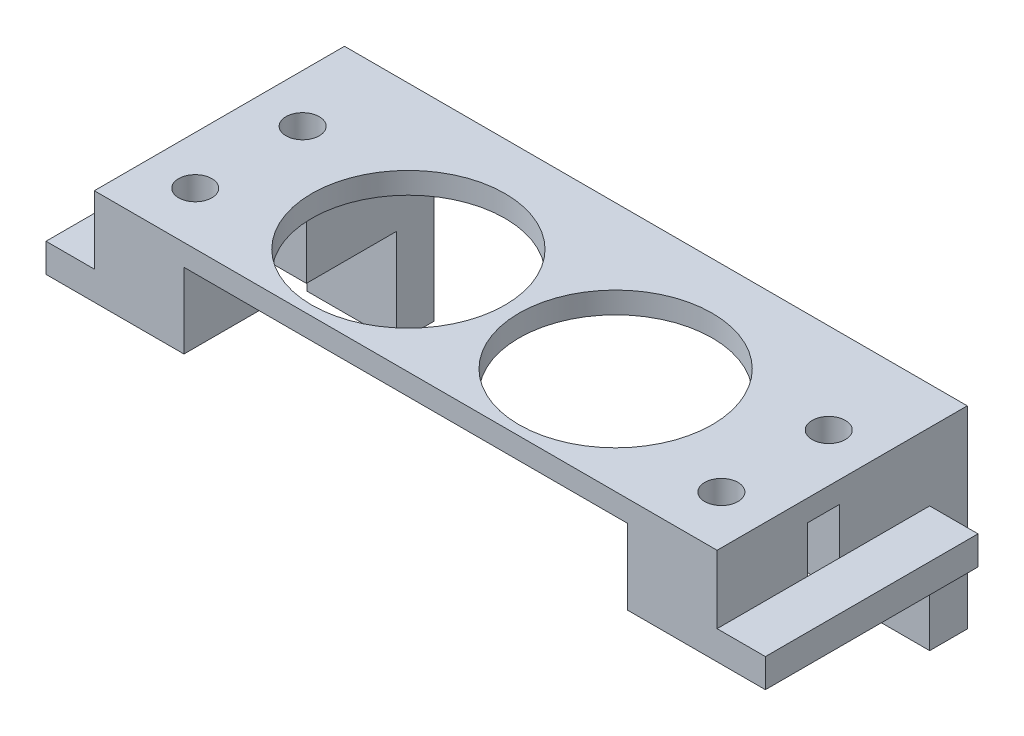
ISO-10303-21;
HEADER;
FILE_DESCRIPTION(('STEP AP214'),'2;1');
FILE_NAME('part.step','',(''),(''),'','','');
FILE_SCHEMA(('AUTOMOTIVE_DESIGN { 1 0 10303 214 1 1 1 1 }'));
ENDSEC;
DATA;
#1=APPLICATION_CONTEXT('core data for automotive mechanical design processes');
#2=APPLICATION_PROTOCOL_DEFINITION('international standard','automotive_design',2000,#1);
#3=PRODUCT_CONTEXT('',#1,'mechanical');
#4=PRODUCT('Part','Part','',(#3));
#5=PRODUCT_RELATED_PRODUCT_CATEGORY('part','',(#4));
#6=PRODUCT_DEFINITION_FORMATION('','',#4);
#7=PRODUCT_DEFINITION_CONTEXT('part definition',#1,'design');
#8=PRODUCT_DEFINITION('design','',#6,#7);
#9=PRODUCT_DEFINITION_SHAPE('','',#8);
#10=(LENGTH_UNIT() NAMED_UNIT(*) SI_UNIT(.MILLI.,.METRE.));
#11=(NAMED_UNIT(*) PLANE_ANGLE_UNIT() SI_UNIT($,.RADIAN.));
#12=(NAMED_UNIT(*) SI_UNIT($,.STERADIAN.) SOLID_ANGLE_UNIT());
#13=UNCERTAINTY_MEASURE_WITH_UNIT(LENGTH_MEASURE(1.E-05),#10,'distance_accuracy_value','');
#14=(GEOMETRIC_REPRESENTATION_CONTEXT(3) GLOBAL_UNCERTAINTY_ASSIGNED_CONTEXT((#13)) GLOBAL_UNIT_ASSIGNED_CONTEXT((#10,
#11,#12)) REPRESENTATION_CONTEXT('',''));
#15=CARTESIAN_POINT('',(0.,0.,0.));
#16=DIRECTION('',(0.,0.,1.));
#17=DIRECTION('',(1.,0.,0.));
#18=AXIS2_PLACEMENT_3D('',#15,#16,#17);
#19=CARTESIAN_POINT('',(-29.,2.,0.));
#20=DIRECTION('',(1.,0.,0.));
#21=DIRECTION('',(0.,0.,-1.));
#22=AXIS2_PLACEMENT_3D('',#19,#20,#21);
#23=PLANE('',#22);
#24=DIRECTION('',(0.,-1.,0.));
#25=VECTOR('',#24,1.);
#26=CARTESIAN_POINT('',(-29.,-4.325,-9.9));
#27=LINE('',#26,#25);
#28=CARTESIAN_POINT('',(-29.,-4.325,-9.9));
#29=VERTEX_POINT('',#28);
#30=CARTESIAN_POINT('',(-29.,-7.,-9.9));
#31=VERTEX_POINT('',#30);
#32=EDGE_CURVE('E249',#29,#31,#27,.T.);
#33=ORIENTED_EDGE('',*,*,#32,.F.);
#34=DIRECTION('',(0.,0.,1.));
#35=VECTOR('',#34,1.);
#36=CARTESIAN_POINT('',(-29.,-4.325,9.9));
#37=LINE('',#36,#35);
#38=CARTESIAN_POINT('',(-29.,-4.325,-1.5));
#39=VERTEX_POINT('',#38);
#40=EDGE_CURVE('E49',#29,#39,#37,.T.);
#41=ORIENTED_EDGE('',*,*,#40,.T.);
#42=DIRECTION('',(0.,1.,0.));
#43=VECTOR('',#42,1.);
#44=CARTESIAN_POINT('',(-29.,-7.,-1.5));
#45=LINE('',#44,#43);
#46=CARTESIAN_POINT('',(-29.,0.,-1.5));
#47=VERTEX_POINT('',#46);
#48=EDGE_CURVE('E399',#39,#47,#45,.T.);
#49=ORIENTED_EDGE('',*,*,#48,.T.);
#50=DIRECTION('',(0.,0.,1.));
#51=VECTOR('',#50,1.);
#52=CARTESIAN_POINT('',(-29.,0.,0.));
#53=LINE('',#52,#51);
#54=CARTESIAN_POINT('',(-29.,0.,1.5));
#55=VERTEX_POINT('',#54);
#56=EDGE_CURVE('E463',#47,#55,#53,.T.);
#57=ORIENTED_EDGE('',*,*,#56,.T.);
#58=DIRECTION('',(0.,1.,0.));
#59=VECTOR('',#58,1.);
#60=CARTESIAN_POINT('',(-29.,-7.,1.5));
#61=LINE('',#60,#59);
#62=CARTESIAN_POINT('',(-29.,-4.325,1.50000000000001));
#63=VERTEX_POINT('',#62);
#64=EDGE_CURVE('E423',#63,#55,#61,.T.);
#65=ORIENTED_EDGE('',*,*,#64,.F.);
#66=CARTESIAN_POINT('',(-29.,-4.325,9.9));
#67=VERTEX_POINT('',#66);
#68=EDGE_CURVE('E11',#63,#67,#37,.T.);
#69=ORIENTED_EDGE('',*,*,#68,.T.);
#70=DIRECTION('',(0.,-1.,0.));
#71=VECTOR('',#70,1.);
#72=CARTESIAN_POINT('',(-29.,2.,9.9));
#73=LINE('',#72,#71);
#74=CARTESIAN_POINT('',(-29.,2.,9.9));
#75=VERTEX_POINT('',#74);
#76=EDGE_CURVE('E42',#75,#67,#73,.T.);
#77=ORIENTED_EDGE('',*,*,#76,.F.);
#78=DIRECTION('',(0.,0.,1.));
#79=VECTOR('',#78,1.);
#80=CARTESIAN_POINT('',(-29.,2.,0.));
#81=LINE('',#80,#79);
#82=CARTESIAN_POINT('',(-29.,2.,-13.4));
#83=VERTEX_POINT('',#82);
#84=EDGE_CURVE('E449',#83,#75,#81,.T.);
#85=ORIENTED_EDGE('',*,*,#84,.F.);
#86=DIRECTION('',(0.,1.,0.));
#87=VECTOR('',#86,1.);
#88=CARTESIAN_POINT('',(-29.,-58.1055074842308,-13.4));
#89=LINE('',#88,#87);
#90=CARTESIAN_POINT('',(-29.,-16.,-13.4));
#91=VERTEX_POINT('',#90);
#92=EDGE_CURVE('E328',#91,#83,#89,.T.);
#93=ORIENTED_EDGE('',*,*,#92,.F.);
#94=DIRECTION('',(0.,0.,-1.));
#95=VECTOR('',#94,1.);
#96=CARTESIAN_POINT('',(-29.,-16.,0.));
#97=LINE('',#96,#95);
#98=CARTESIAN_POINT('',(-29.,-16.,-9.9));
#99=VERTEX_POINT('',#98);
#100=EDGE_CURVE('E291',#99,#91,#97,.T.);
#101=ORIENTED_EDGE('',*,*,#100,.F.);
#102=DIRECTION('',(0.,1.,0.));
#103=VECTOR('',#102,1.);
#104=CARTESIAN_POINT('',(-29.,-16.,-9.9));
#105=LINE('',#104,#103);
#106=EDGE_CURVE('E295',#99,#31,#105,.T.);
#107=ORIENTED_EDGE('',*,*,#106,.T.);
#108=EDGE_LOOP('',(#33,#41,#49,#57,#65,#69,#77,#85,#93,#101,#107));
#109=FACE_BOUND('',#108,.T.);
#110=ADVANCED_FACE('F38',(#109),#23,.F.);
#111=CARTESIAN_POINT('',(29.,2.,0.));
#112=DIRECTION('',(1.,0.,0.));
#113=DIRECTION('',(0.,0.,-1.));
#114=AXIS2_PLACEMENT_3D('',#111,#112,#113);
#115=PLANE('',#114);
#116=DIRECTION('',(0.,-1.,0.));
#117=VECTOR('',#116,1.);
#118=CARTESIAN_POINT('',(29.,2.,9.9));
#119=LINE('',#118,#117);
#120=CARTESIAN_POINT('',(29.,2.,9.9));
#121=VERTEX_POINT('',#120);
#122=CARTESIAN_POINT('',(29.,-4.325,9.9));
#123=VERTEX_POINT('',#122);
#124=EDGE_CURVE('E454',#121,#123,#119,.T.);
#125=ORIENTED_EDGE('',*,*,#124,.T.);
#126=DIRECTION('',(0.,0.,-1.));
#127=VECTOR('',#126,1.);
#128=CARTESIAN_POINT('',(29.,-4.325,9.9));
#129=LINE('',#128,#127);
#130=CARTESIAN_POINT('',(29.,-4.325,1.5));
#131=VERTEX_POINT('',#130);
#132=EDGE_CURVE('E253',#123,#131,#129,.T.);
#133=ORIENTED_EDGE('',*,*,#132,.T.);
#134=DIRECTION('',(0.,1.,0.));
#135=VECTOR('',#134,1.);
#136=CARTESIAN_POINT('',(29.,-7.,1.5));
#137=LINE('',#136,#135);
#138=CARTESIAN_POINT('',(29.,0.,1.5));
#139=VERTEX_POINT('',#138);
#140=EDGE_CURVE('E374',#131,#139,#137,.T.);
#141=ORIENTED_EDGE('',*,*,#140,.T.);
#142=DIRECTION('',(0.,0.,1.));
#143=VECTOR('',#142,1.);
#144=CARTESIAN_POINT('',(29.,0.,0.));
#145=LINE('',#144,#143);
#146=CARTESIAN_POINT('',(29.,0.,-1.5));
#147=VERTEX_POINT('',#146);
#148=EDGE_CURVE('E460',#147,#139,#145,.T.);
#149=ORIENTED_EDGE('',*,*,#148,.F.);
#150=DIRECTION('',(0.,1.,0.));
#151=VECTOR('',#150,1.);
#152=CARTESIAN_POINT('',(29.,-7.,-1.5));
#153=LINE('',#152,#151);
#154=CARTESIAN_POINT('',(29.,-4.325,-1.49999999999999));
#155=VERTEX_POINT('',#154);
#156=EDGE_CURVE('E345',#155,#147,#153,.T.);
#157=ORIENTED_EDGE('',*,*,#156,.F.);
#158=CARTESIAN_POINT('',(29.,-4.325,-9.9));
#159=VERTEX_POINT('',#158);
#160=EDGE_CURVE('E47',#155,#159,#129,.T.);
#161=ORIENTED_EDGE('',*,*,#160,.T.);
#162=DIRECTION('',(0.,-1.,0.));
#163=VECTOR('',#162,1.);
#164=CARTESIAN_POINT('',(29.,-4.325,-9.9));
#165=LINE('',#164,#163);
#166=CARTESIAN_POINT('',(29.,-7.,-9.9));
#167=VERTEX_POINT('',#166);
#168=EDGE_CURVE('E266',#159,#167,#165,.T.);
#169=ORIENTED_EDGE('',*,*,#168,.T.);
#170=DIRECTION('',(0.,1.,0.));
#171=VECTOR('',#170,1.);
#172=CARTESIAN_POINT('',(29.,-16.,-9.9));
#173=LINE('',#172,#171);
#174=CARTESIAN_POINT('',(29.,-16.,-9.9));
#175=VERTEX_POINT('',#174);
#176=EDGE_CURVE('E317',#175,#167,#173,.T.);
#177=ORIENTED_EDGE('',*,*,#176,.F.);
#178=DIRECTION('',(0.,0.,-1.));
#179=VECTOR('',#178,1.);
#180=CARTESIAN_POINT('',(29.,-16.,0.));
#181=LINE('',#180,#179);
#182=CARTESIAN_POINT('',(29.,-16.,-13.4));
#183=VERTEX_POINT('',#182);
#184=EDGE_CURVE('E306',#175,#183,#181,.T.);
#185=ORIENTED_EDGE('',*,*,#184,.T.);
#186=DIRECTION('',(0.,1.,0.));
#187=VECTOR('',#186,1.);
#188=CARTESIAN_POINT('',(29.,-58.1055074842308,-13.4));
#189=LINE('',#188,#187);
#190=CARTESIAN_POINT('',(29.,2.,-13.4));
#191=VERTEX_POINT('',#190);
#192=EDGE_CURVE('E326',#183,#191,#189,.T.);
#193=ORIENTED_EDGE('',*,*,#192,.T.);
#194=DIRECTION('',(0.,0.,1.));
#195=VECTOR('',#194,1.);
#196=CARTESIAN_POINT('',(29.,2.,0.));
#197=LINE('',#196,#195);
#198=EDGE_CURVE('E447',#191,#121,#197,.T.);
#199=ORIENTED_EDGE('',*,*,#198,.T.);
#200=EDGE_LOOP('',(#125,#133,#141,#149,#157,#161,#169,#177,#185,#193,#199));
#201=FACE_BOUND('',#200,.T.);
#202=ADVANCED_FACE('F478',(#201),#115,.T.);
#203=CARTESIAN_POINT('',(0.,0.,0.));
#204=DIRECTION('',(0.,1.,0.));
#205=DIRECTION('',(0.,0.,1.));
#206=AXIS2_PLACEMENT_3D('',#203,#204,#205);
#207=PLANE('',#206);
#208=CARTESIAN_POINT('',(9.65,0.,0.));
#209=DIRECTION('',(0.,1.,0.));
#210=DIRECTION('',(0.,0.,1.));
#211=AXIS2_PLACEMENT_3D('',#208,#209,#210);
#212=CIRCLE('',#211,9.);
#213=CARTESIAN_POINT('',(9.65,0.,9.));
#214=VERTEX_POINT('',#213);
#215=EDGE_CURVE('E427',#214,#214,#212,.T.);
#216=ORIENTED_EDGE('',*,*,#215,.T.);
#217=EDGE_LOOP('',(#216));
#218=FACE_BOUND('',#217,.T.);
#219=CARTESIAN_POINT('',(-9.65,0.,0.));
#220=DIRECTION('',(0.,1.,0.));
#221=DIRECTION('',(0.,0.,1.));
#222=AXIS2_PLACEMENT_3D('',#219,#220,#221);
#223=CIRCLE('',#222,9.);
#224=CARTESIAN_POINT('',(-9.65,0.,9.));
#225=VERTEX_POINT('',#224);
#226=EDGE_CURVE('E457',#225,#225,#223,.T.);
#227=ORIENTED_EDGE('',*,*,#226,.T.);
#228=EDGE_LOOP('',(#227));
#229=FACE_BOUND('',#228,.T.);
#230=DIRECTION('',(0.,0.,-1.));
#231=VECTOR('',#230,1.);
#232=CARTESIAN_POINT('',(-20.65,0.,0.));
#233=LINE('',#232,#231);
#234=CARTESIAN_POINT('',(-20.65,0.,-1.5));
#235=VERTEX_POINT('',#234);
#236=CARTESIAN_POINT('',(-20.65,0.,-13.4));
#237=VERTEX_POINT('',#236);
#238=EDGE_CURVE('E385',#235,#237,#233,.T.);
#239=ORIENTED_EDGE('',*,*,#238,.T.);
#240=DIRECTION('',(1.,0.,0.));
#241=VECTOR('',#240,1.);
#242=CARTESIAN_POINT('',(0.,0.,-13.4));
#243=LINE('',#242,#241);
#244=CARTESIAN_POINT('',(20.65,0.,-13.4));
#245=VERTEX_POINT('',#244);
#246=EDGE_CURVE('E322',#237,#245,#243,.T.);
#247=ORIENTED_EDGE('',*,*,#246,.T.);
#248=DIRECTION('',(0.,0.,-1.));
#249=VECTOR('',#248,1.);
#250=CARTESIAN_POINT('',(20.65,0.,0.));
#251=LINE('',#250,#249);
#252=CARTESIAN_POINT('',(20.65,0.,-1.5));
#253=VERTEX_POINT('',#252);
#254=EDGE_CURVE('E336',#253,#245,#251,.T.);
#255=ORIENTED_EDGE('',*,*,#254,.F.);
#256=DIRECTION('',(1.,0.,0.));
#257=VECTOR('',#256,1.);
#258=CARTESIAN_POINT('',(0.,0.,-1.5));
#259=LINE('',#258,#257);
#260=EDGE_CURVE('E325',#253,#147,#259,.T.);
#261=ORIENTED_EDGE('',*,*,#260,.T.);
#262=ORIENTED_EDGE('',*,*,#148,.T.);
#263=DIRECTION('',(1.,0.,0.));
#264=VECTOR('',#263,1.);
#265=CARTESIAN_POINT('',(0.,0.,1.5));
#266=LINE('',#265,#264);
#267=CARTESIAN_POINT('',(20.65,0.,1.5));
#268=VERTEX_POINT('',#267);
#269=EDGE_CURVE('E360',#268,#139,#266,.T.);
#270=ORIENTED_EDGE('',*,*,#269,.F.);
#271=DIRECTION('',(0.,0.,-1.));
#272=VECTOR('',#271,1.);
#273=CARTESIAN_POINT('',(20.65,0.,0.));
#274=LINE('',#273,#272);
#275=CARTESIAN_POINT('',(20.65,0.,9.9));
#276=VERTEX_POINT('',#275);
#277=EDGE_CURVE('E355',#276,#268,#274,.T.);
#278=ORIENTED_EDGE('',*,*,#277,.F.);
#279=DIRECTION('',(1.,0.,0.));
#280=VECTOR('',#279,1.);
#281=CARTESIAN_POINT('',(0.,0.,9.9));
#282=LINE('',#281,#280);
#283=CARTESIAN_POINT('',(-20.65,0.,9.9));
#284=VERTEX_POINT('',#283);
#285=EDGE_CURVE('E432',#284,#276,#282,.T.);
#286=ORIENTED_EDGE('',*,*,#285,.F.);
#287=DIRECTION('',(0.,0.,-1.));
#288=VECTOR('',#287,1.);
#289=CARTESIAN_POINT('',(-20.65,0.,0.));
#290=LINE('',#289,#288);
#291=CARTESIAN_POINT('',(-20.65,0.,1.5));
#292=VERTEX_POINT('',#291);
#293=EDGE_CURVE('E407',#284,#292,#290,.T.);
#294=ORIENTED_EDGE('',*,*,#293,.T.);
#295=DIRECTION('',(1.,0.,0.));
#296=VECTOR('',#295,1.);
#297=CARTESIAN_POINT('',(0.,0.,1.5));
#298=LINE('',#297,#296);
#299=EDGE_CURVE('E402',#55,#292,#298,.T.);
#300=ORIENTED_EDGE('',*,*,#299,.F.);
#301=ORIENTED_EDGE('',*,*,#56,.F.);
#302=DIRECTION('',(1.,0.,0.));
#303=VECTOR('',#302,1.);
#304=CARTESIAN_POINT('',(0.,0.,-1.5));
#305=LINE('',#304,#303);
#306=EDGE_CURVE('E380',#47,#235,#305,.T.);
#307=ORIENTED_EDGE('',*,*,#306,.T.);
#308=EDGE_LOOP('',(#239,#247,#255,#261,#262,#270,#278,#286,#294,#300,#301,#307));
#309=FACE_BOUND('',#308,.T.);
#310=ADVANCED_FACE('F494',(#218,#229,#309),#207,.F.);
#311=CARTESIAN_POINT('',(-9.65,2.,0.));
#312=DIRECTION('',(0.,-1.,0.));
#313=DIRECTION('',(0.,0.,-1.));
#314=AXIS2_PLACEMENT_3D('',#311,#312,#313);
#315=CYLINDRICAL_SURFACE('',#314,9.);
#316=CARTESIAN_POINT('',(-9.65,2.,0.));
#317=DIRECTION('',(0.,1.,0.));
#318=DIRECTION('',(0.,0.,1.));
#319=AXIS2_PLACEMENT_3D('',#316,#317,#318);
#320=CIRCLE('',#319,9.);
#321=CARTESIAN_POINT('',(-9.65,2.,9.));
#322=VERTEX_POINT('',#321);
#323=EDGE_CURVE('E444',#322,#322,#320,.T.);
#324=ORIENTED_EDGE('',*,*,#323,.T.);
#325=EDGE_LOOP('',(#324));
#326=FACE_BOUND('',#325,.T.);
#327=ORIENTED_EDGE('',*,*,#226,.F.);
#328=EDGE_LOOP('',(#327));
#329=FACE_BOUND('',#328,.T.);
#330=ADVANCED_FACE('F547',(#326,#329),#315,.F.);
#331=CARTESIAN_POINT('',(-24.5,2.,-5.));
#332=DIRECTION('',(0.,-1.,0.));
#333=DIRECTION('',(0.,0.,-1.));
#334=AXIS2_PLACEMENT_3D('',#331,#332,#333);
#335=CYLINDRICAL_SURFACE('',#334,1.55);
#336=CARTESIAN_POINT('',(-24.5,2.,-5.));
#337=DIRECTION('',(0.,1.,0.));
#338=DIRECTION('',(0.,0.,1.));
#339=AXIS2_PLACEMENT_3D('',#336,#337,#338);
#340=CIRCLE('',#339,1.55);
#341=CARTESIAN_POINT('',(-24.5,2.,-3.45));
#342=VERTEX_POINT('',#341);
#343=EDGE_CURVE('E441',#342,#342,#340,.T.);
#344=ORIENTED_EDGE('',*,*,#343,.T.);
#345=EDGE_LOOP('',(#344));
#346=FACE_BOUND('',#345,.T.);
#347=CARTESIAN_POINT('',(-24.5,-7.,-5.));
#348=DIRECTION('',(0.,-1.,0.));
#349=DIRECTION('',(0.,0.,-1.));
#350=AXIS2_PLACEMENT_3D('',#347,#348,#349);
#351=CIRCLE('',#350,1.55);
#352=CARTESIAN_POINT('',(-24.5,-7.,-6.55));
#353=VERTEX_POINT('',#352);
#354=EDGE_CURVE('E391',#353,#353,#351,.F.);
#355=ORIENTED_EDGE('',*,*,#354,.F.);
#356=EDGE_LOOP('',(#355));
#357=FACE_BOUND('',#356,.T.);
#358=ADVANCED_FACE('F550',(#346,#357),#335,.F.);
#359=CARTESIAN_POINT('',(-24.5,2.,5.));
#360=DIRECTION('',(0.,-1.,0.));
#361=DIRECTION('',(0.,0.,-1.));
#362=AXIS2_PLACEMENT_3D('',#359,#360,#361);
#363=CYLINDRICAL_SURFACE('',#362,1.55);
#364=CARTESIAN_POINT('',(-24.5,2.,5.));
#365=DIRECTION('',(0.,1.,0.));
#366=DIRECTION('',(0.,0.,1.));
#367=AXIS2_PLACEMENT_3D('',#364,#365,#366);
#368=CIRCLE('',#367,1.55);
#369=CARTESIAN_POINT('',(-24.5,2.,6.55));
#370=VERTEX_POINT('',#369);
#371=EDGE_CURVE('E438',#370,#370,#368,.T.);
#372=ORIENTED_EDGE('',*,*,#371,.T.);
#373=EDGE_LOOP('',(#372));
#374=FACE_BOUND('',#373,.T.);
#375=CARTESIAN_POINT('',(-24.5,-7.,5.));
#376=DIRECTION('',(0.,-1.,0.));
#377=DIRECTION('',(0.,0.,-1.));
#378=AXIS2_PLACEMENT_3D('',#375,#376,#377);
#379=CIRCLE('',#378,1.55);
#380=CARTESIAN_POINT('',(-24.5,-7.,3.45));
#381=VERTEX_POINT('',#380);
#382=EDGE_CURVE('E403',#381,#381,#379,.F.);
#383=ORIENTED_EDGE('',*,*,#382,.F.);
#384=EDGE_LOOP('',(#383));
#385=FACE_BOUND('',#384,.T.);
#386=ADVANCED_FACE('F554',(#374,#385),#363,.F.);
#387=CARTESIAN_POINT('',(24.5,2.,-5.00000000000001));
#388=DIRECTION('',(0.,-1.,0.));
#389=DIRECTION('',(0.,0.,-1.));
#390=AXIS2_PLACEMENT_3D('',#387,#388,#389);
#391=CYLINDRICAL_SURFACE('',#390,1.55);
#392=CARTESIAN_POINT('',(24.5,2.,-5.00000000000001));
#393=DIRECTION('',(0.,1.,0.));
#394=DIRECTION('',(0.,0.,1.));
#395=AXIS2_PLACEMENT_3D('',#392,#393,#394);
#396=CIRCLE('',#395,1.55);
#397=CARTESIAN_POINT('',(24.5,2.,-3.45000000000001));
#398=VERTEX_POINT('',#397);
#399=EDGE_CURVE('E435',#398,#398,#396,.T.);
#400=ORIENTED_EDGE('',*,*,#399,.T.);
#401=EDGE_LOOP('',(#400));
#402=FACE_BOUND('',#401,.T.);
#403=CARTESIAN_POINT('',(24.5,-7.,-5.00000000000001));
#404=DIRECTION('',(0.,-1.,0.));
#405=DIRECTION('',(0.,0.,-1.));
#406=AXIS2_PLACEMENT_3D('',#403,#404,#405);
#407=CIRCLE('',#406,1.55);
#408=CARTESIAN_POINT('',(24.5,-7.,-6.55000000000001));
#409=VERTEX_POINT('',#408);
#410=EDGE_CURVE('E342',#409,#409,#407,.F.);
#411=ORIENTED_EDGE('',*,*,#410,.F.);
#412=EDGE_LOOP('',(#411));
#413=FACE_BOUND('',#412,.T.);
#414=ADVANCED_FACE('F558',(#402,#413),#391,.F.);
#415=CARTESIAN_POINT('',(24.5,2.,5.00000000000001));
#416=DIRECTION('',(0.,-1.,0.));
#417=DIRECTION('',(0.,0.,-1.));
#418=AXIS2_PLACEMENT_3D('',#415,#416,#417);
#419=CYLINDRICAL_SURFACE('',#418,1.55);
#420=CARTESIAN_POINT('',(24.5,2.,5.00000000000001));
#421=DIRECTION('',(0.,1.,0.));
#422=DIRECTION('',(0.,0.,1.));
#423=AXIS2_PLACEMENT_3D('',#420,#421,#422);
#424=CIRCLE('',#423,1.55);
#425=CARTESIAN_POINT('',(24.5,2.,6.55000000000001));
#426=VERTEX_POINT('',#425);
#427=EDGE_CURVE('E431',#426,#426,#424,.T.);
#428=ORIENTED_EDGE('',*,*,#427,.T.);
#429=EDGE_LOOP('',(#428));
#430=FACE_BOUND('',#429,.T.);
#431=CARTESIAN_POINT('',(24.5,-7.,5.00000000000001));
#432=DIRECTION('',(0.,-1.,0.));
#433=DIRECTION('',(0.,0.,-1.));
#434=AXIS2_PLACEMENT_3D('',#431,#432,#433);
#435=CIRCLE('',#434,1.55);
#436=CARTESIAN_POINT('',(24.5,-7.,3.45000000000001));
#437=VERTEX_POINT('',#436);
#438=EDGE_CURVE('E356',#437,#437,#435,.F.);
#439=ORIENTED_EDGE('',*,*,#438,.F.);
#440=EDGE_LOOP('',(#439));
#441=FACE_BOUND('',#440,.T.);
#442=ADVANCED_FACE('F561',(#430,#441),#419,.F.);
#443=CARTESIAN_POINT('',(9.65,2.,0.));
#444=DIRECTION('',(0.,-1.,0.));
#445=DIRECTION('',(0.,0.,-1.));
#446=AXIS2_PLACEMENT_3D('',#443,#444,#445);
#447=CYLINDRICAL_SURFACE('',#446,9.);
#448=CARTESIAN_POINT('',(9.65,2.,0.));
#449=DIRECTION('',(0.,1.,0.));
#450=DIRECTION('',(0.,0.,1.));
#451=AXIS2_PLACEMENT_3D('',#448,#449,#450);
#452=CIRCLE('',#451,9.);
#453=CARTESIAN_POINT('',(9.65,2.,9.));
#454=VERTEX_POINT('',#453);
#455=EDGE_CURVE('E428',#454,#454,#452,.T.);
#456=ORIENTED_EDGE('',*,*,#455,.T.);
#457=EDGE_LOOP('',(#456));
#458=FACE_BOUND('',#457,.T.);
#459=ORIENTED_EDGE('',*,*,#215,.F.);
#460=EDGE_LOOP('',(#459));
#461=FACE_BOUND('',#460,.T.);
#462=ADVANCED_FACE('F40',(#458,#461),#447,.F.);
#463=CARTESIAN_POINT('',(0.,2.,9.9));
#464=DIRECTION('',(0.,0.,-1.));
#465=DIRECTION('',(-1.,0.,0.));
#466=AXIS2_PLACEMENT_3D('',#463,#464,#465);
#467=PLANE('',#466);
#468=ORIENTED_EDGE('',*,*,#76,.T.);
#469=DIRECTION('',(-1.,0.,0.));
#470=VECTOR('',#469,1.);
#471=CARTESIAN_POINT('',(-29.,-4.325,9.9));
#472=LINE('',#471,#470);
#473=CARTESIAN_POINT('',(-33.5,-4.325,9.9));
#474=VERTEX_POINT('',#473);
#475=EDGE_CURVE('E57',#67,#474,#472,.T.);
#476=ORIENTED_EDGE('',*,*,#475,.T.);
#477=DIRECTION('',(0.,-1.,0.));
#478=VECTOR('',#477,1.);
#479=CARTESIAN_POINT('',(-33.5,-4.325,9.9));
#480=LINE('',#479,#478);
#481=CARTESIAN_POINT('',(-33.5,-7.,9.9));
#482=VERTEX_POINT('',#481);
#483=EDGE_CURVE('E220',#474,#482,#480,.T.);
#484=ORIENTED_EDGE('',*,*,#483,.T.);
#485=DIRECTION('',(-1.,0.,0.));
#486=VECTOR('',#485,1.);
#487=CARTESIAN_POINT('',(0.,-7.,9.9));
#488=LINE('',#487,#486);
#489=CARTESIAN_POINT('',(-20.65,-7.,9.9));
#490=VERTEX_POINT('',#489);
#491=EDGE_CURVE('E412',#490,#482,#488,.T.);
#492=ORIENTED_EDGE('',*,*,#491,.F.);
#493=DIRECTION('',(0.,1.,0.));
#494=VECTOR('',#493,1.);
#495=CARTESIAN_POINT('',(-20.65,-7.,9.9));
#496=LINE('',#495,#494);
#497=EDGE_CURVE('E414',#490,#284,#496,.T.);
#498=ORIENTED_EDGE('',*,*,#497,.T.);
#499=ORIENTED_EDGE('',*,*,#285,.T.);
#500=DIRECTION('',(0.,1.,0.));
#501=VECTOR('',#500,1.);
#502=CARTESIAN_POINT('',(20.65,-7.,9.9));
#503=LINE('',#502,#501);
#504=CARTESIAN_POINT('',(20.65,-7.,9.9));
#505=VERTEX_POINT('',#504);
#506=EDGE_CURVE('E368',#505,#276,#503,.T.);
#507=ORIENTED_EDGE('',*,*,#506,.F.);
#508=DIRECTION('',(-1.,0.,0.));
#509=VECTOR('',#508,1.);
#510=CARTESIAN_POINT('',(0.,-7.,9.9));
#511=LINE('',#510,#509);
#512=CARTESIAN_POINT('',(33.5,-7.,9.9));
#513=VERTEX_POINT('',#512);
#514=EDGE_CURVE('E366',#513,#505,#511,.T.);
#515=ORIENTED_EDGE('',*,*,#514,.F.);
#516=DIRECTION('',(0.,-1.,0.));
#517=VECTOR('',#516,1.);
#518=CARTESIAN_POINT('',(33.5,-4.325,9.9));
#519=LINE('',#518,#517);
#520=CARTESIAN_POINT('',(33.5,-4.325,9.9));
#521=VERTEX_POINT('',#520);
#522=EDGE_CURVE('E275',#521,#513,#519,.T.);
#523=ORIENTED_EDGE('',*,*,#522,.F.);
#524=DIRECTION('',(-1.,0.,0.));
#525=VECTOR('',#524,1.);
#526=CARTESIAN_POINT('',(29.,-4.325,9.9));
#527=LINE('',#526,#525);
#528=EDGE_CURVE('E263',#521,#123,#527,.T.);
#529=ORIENTED_EDGE('',*,*,#528,.T.);
#530=ORIENTED_EDGE('',*,*,#124,.F.);
#531=DIRECTION('',(1.,0.,0.));
#532=VECTOR('',#531,1.);
#533=CARTESIAN_POINT('',(0.,2.,9.9));
#534=LINE('',#533,#532);
#535=EDGE_CURVE('E451',#75,#121,#534,.T.);
#536=ORIENTED_EDGE('',*,*,#535,.F.);
#537=EDGE_LOOP('',(#468,#476,#484,#492,#498,#499,#507,#515,#523,#529,#530,#536));
#538=FACE_BOUND('',#537,.T.);
#539=ADVANCED_FACE('F235',(#538),#467,.F.);
#540=CARTESIAN_POINT('',(0.,2.,0.));
#541=DIRECTION('',(0.,1.,0.));
#542=DIRECTION('',(0.,0.,1.));
#543=AXIS2_PLACEMENT_3D('',#540,#541,#542);
#544=PLANE('',#543);
#545=DIRECTION('',(-1.,0.,0.));
#546=VECTOR('',#545,1.);
#547=CARTESIAN_POINT('',(0.,2.,-13.4));
#548=LINE('',#547,#546);
#549=EDGE_CURVE('E316',#191,#83,#548,.T.);
#550=ORIENTED_EDGE('',*,*,#549,.T.);
#551=ORIENTED_EDGE('',*,*,#84,.T.);
#552=ORIENTED_EDGE('',*,*,#535,.T.);
#553=ORIENTED_EDGE('',*,*,#198,.F.);
#554=EDGE_LOOP('',(#550,#551,#552,#553));
#555=FACE_BOUND('',#554,.T.);
#556=ORIENTED_EDGE('',*,*,#455,.F.);
#557=EDGE_LOOP('',(#556));
#558=FACE_BOUND('',#557,.T.);
#559=ORIENTED_EDGE('',*,*,#427,.F.);
#560=EDGE_LOOP('',(#559));
#561=FACE_BOUND('',#560,.T.);
#562=ORIENTED_EDGE('',*,*,#399,.F.);
#563=EDGE_LOOP('',(#562));
#564=FACE_BOUND('',#563,.T.);
#565=ORIENTED_EDGE('',*,*,#371,.F.);
#566=EDGE_LOOP('',(#565));
#567=FACE_BOUND('',#566,.T.);
#568=ORIENTED_EDGE('',*,*,#343,.F.);
#569=EDGE_LOOP('',(#568));
#570=FACE_BOUND('',#569,.T.);
#571=ORIENTED_EDGE('',*,*,#323,.F.);
#572=EDGE_LOOP('',(#571));
#573=FACE_BOUND('',#572,.T.);
#574=ADVANCED_FACE('F519',(#555,#558,#561,#564,#567,#570,#573),#544,.T.);
#575=CARTESIAN_POINT('',(0.,-7.,1.5));
#576=DIRECTION('',(0.,0.,1.));
#577=DIRECTION('',(1.,0.,0.));
#578=AXIS2_PLACEMENT_3D('',#575,#576,#577);
#579=PLANE('',#578);
#580=ORIENTED_EDGE('',*,*,#299,.T.);
#581=DIRECTION('',(0.,1.,0.));
#582=VECTOR('',#581,1.);
#583=CARTESIAN_POINT('',(-20.65,-7.,1.5));
#584=LINE('',#583,#582);
#585=CARTESIAN_POINT('',(-20.65,-7.,1.5));
#586=VERTEX_POINT('',#585);
#587=EDGE_CURVE('E420',#586,#292,#584,.T.);
#588=ORIENTED_EDGE('',*,*,#587,.F.);
#589=DIRECTION('',(1.,0.,0.));
#590=VECTOR('',#589,1.);
#591=CARTESIAN_POINT('',(0.,-7.,1.5));
#592=LINE('',#591,#590);
#593=CARTESIAN_POINT('',(-29.,-7.,1.5));
#594=VERTEX_POINT('',#593);
#595=EDGE_CURVE('E406',#594,#586,#592,.T.);
#596=ORIENTED_EDGE('',*,*,#595,.F.);
#597=EDGE_CURVE('E424',#594,#63,#61,.T.);
#598=ORIENTED_EDGE('',*,*,#597,.T.);
#599=ORIENTED_EDGE('',*,*,#64,.T.);
#600=EDGE_LOOP('',(#580,#588,#596,#598,#599));
#601=FACE_BOUND('',#600,.T.);
#602=ADVANCED_FACE('F602',(#601),#579,.F.);
#603=CARTESIAN_POINT('',(-20.65,-7.,0.));
#604=DIRECTION('',(1.,0.,0.));
#605=DIRECTION('',(0.,0.,-1.));
#606=AXIS2_PLACEMENT_3D('',#603,#604,#605);
#607=PLANE('',#606);
#608=ORIENTED_EDGE('',*,*,#293,.F.);
#609=ORIENTED_EDGE('',*,*,#497,.F.);
#610=DIRECTION('',(0.,0.,-1.));
#611=VECTOR('',#610,1.);
#612=CARTESIAN_POINT('',(-20.65,-7.,0.));
#613=LINE('',#612,#611);
#614=EDGE_CURVE('E409',#490,#586,#613,.T.);
#615=ORIENTED_EDGE('',*,*,#614,.T.);
#616=ORIENTED_EDGE('',*,*,#587,.T.);
#617=EDGE_LOOP('',(#608,#609,#615,#616));
#618=FACE_BOUND('',#617,.T.);
#619=ADVANCED_FACE('F598',(#618),#607,.T.);
#620=CARTESIAN_POINT('',(0.,-7.,0.));
#621=DIRECTION('',(0.,-1.,0.));
#622=DIRECTION('',(0.,0.,-1.));
#623=AXIS2_PLACEMENT_3D('',#620,#621,#622);
#624=PLANE('',#623);
#625=ORIENTED_EDGE('',*,*,#382,.T.);
#626=EDGE_LOOP('',(#625));
#627=FACE_BOUND('',#626,.T.);
#628=ORIENTED_EDGE('',*,*,#491,.T.);
#629=DIRECTION('',(0.,0.,-1.));
#630=VECTOR('',#629,1.);
#631=CARTESIAN_POINT('',(-33.5,-7.,9.9));
#632=LINE('',#631,#630);
#633=CARTESIAN_POINT('',(-33.5,-7.,-9.9));
#634=VERTEX_POINT('',#633);
#635=EDGE_CURVE('E225',#482,#634,#632,.T.);
#636=ORIENTED_EDGE('',*,*,#635,.T.);
#637=DIRECTION('',(1.,0.,0.));
#638=VECTOR('',#637,1.);
#639=CARTESIAN_POINT('',(-29.,-7.,-9.9));
#640=LINE('',#639,#638);
#641=EDGE_CURVE('E246',#634,#31,#640,.T.);
#642=ORIENTED_EDGE('',*,*,#641,.T.);
#643=DIRECTION('',(1.,0.,0.));
#644=VECTOR('',#643,1.);
#645=CARTESIAN_POINT('',(0.,-7.,-9.9));
#646=LINE('',#645,#644);
#647=CARTESIAN_POINT('',(-20.65,-7.,-9.9));
#648=VERTEX_POINT('',#647);
#649=EDGE_CURVE('E384',#31,#648,#646,.T.);
#650=ORIENTED_EDGE('',*,*,#649,.T.);
#651=DIRECTION('',(0.,0.,-1.));
#652=VECTOR('',#651,1.);
#653=CARTESIAN_POINT('',(-20.65,-7.,0.));
#654=LINE('',#653,#652);
#655=CARTESIAN_POINT('',(-20.65,-7.,-1.5));
#656=VERTEX_POINT('',#655);
#657=EDGE_CURVE('E388',#656,#648,#654,.T.);
#658=ORIENTED_EDGE('',*,*,#657,.F.);
#659=DIRECTION('',(1.,0.,0.));
#660=VECTOR('',#659,1.);
#661=CARTESIAN_POINT('',(0.,-7.,-1.5));
#662=LINE('',#661,#660);
#663=CARTESIAN_POINT('',(-29.,-7.,-1.5));
#664=VERTEX_POINT('',#663);
#665=EDGE_CURVE('E381',#664,#656,#662,.T.);
#666=ORIENTED_EDGE('',*,*,#665,.F.);
#667=DIRECTION('',(0.,0.,1.));
#668=VECTOR('',#667,1.);
#669=CARTESIAN_POINT('',(-29.,-7.,9.9));
#670=LINE('',#669,#668);
#671=EDGE_CURVE('E242',#664,#594,#670,.T.);
#672=ORIENTED_EDGE('',*,*,#671,.T.);
#673=ORIENTED_EDGE('',*,*,#595,.T.);
#674=ORIENTED_EDGE('',*,*,#614,.F.);
#675=EDGE_LOOP('',(#628,#636,#642,#650,#658,#666,#672,#673,#674));
#676=FACE_BOUND('',#675,.T.);
#677=ORIENTED_EDGE('',*,*,#354,.T.);
#678=EDGE_LOOP('',(#677));
#679=FACE_BOUND('',#678,.T.);
#680=ADVANCED_FACE('F594',(#627,#676,#679),#624,.T.);
#681=CARTESIAN_POINT('',(0.,-7.,-1.5));
#682=DIRECTION('',(0.,0.,1.));
#683=DIRECTION('',(1.,0.,0.));
#684=AXIS2_PLACEMENT_3D('',#681,#682,#683);
#685=PLANE('',#684);
#686=ORIENTED_EDGE('',*,*,#306,.F.);
#687=ORIENTED_EDGE('',*,*,#48,.F.);
#688=EDGE_CURVE('E400',#664,#39,#45,.T.);
#689=ORIENTED_EDGE('',*,*,#688,.F.);
#690=ORIENTED_EDGE('',*,*,#665,.T.);
#691=DIRECTION('',(0.,1.,0.));
#692=VECTOR('',#691,1.);
#693=CARTESIAN_POINT('',(-20.65,-7.,-1.5));
#694=LINE('',#693,#692);
#695=EDGE_CURVE('E394',#656,#235,#694,.T.);
#696=ORIENTED_EDGE('',*,*,#695,.T.);
#697=EDGE_LOOP('',(#686,#687,#689,#690,#696));
#698=FACE_BOUND('',#697,.T.);
#699=ADVANCED_FACE('F590',(#698),#685,.T.);
#700=CARTESIAN_POINT('',(-20.65,-7.,0.));
#701=DIRECTION('',(1.,0.,0.));
#702=DIRECTION('',(0.,0.,-1.));
#703=AXIS2_PLACEMENT_3D('',#700,#701,#702);
#704=PLANE('',#703);
#705=DIRECTION('',(0.,1.,0.));
#706=VECTOR('',#705,1.);
#707=CARTESIAN_POINT('',(-20.65,-16.,-13.4));
#708=LINE('',#707,#706);
#709=CARTESIAN_POINT('',(-20.65,-16.,-13.4));
#710=VERTEX_POINT('',#709);
#711=EDGE_CURVE('E299',#710,#237,#708,.T.);
#712=ORIENTED_EDGE('',*,*,#711,.T.);
#713=ORIENTED_EDGE('',*,*,#238,.F.);
#714=ORIENTED_EDGE('',*,*,#695,.F.);
#715=ORIENTED_EDGE('',*,*,#657,.T.);
#716=DIRECTION('',(0.,1.,0.));
#717=VECTOR('',#716,1.);
#718=CARTESIAN_POINT('',(-20.65,-16.,-9.9));
#719=LINE('',#718,#717);
#720=CARTESIAN_POINT('',(-20.65,-16.,-9.9));
#721=VERTEX_POINT('',#720);
#722=EDGE_CURVE('E294',#721,#648,#719,.T.);
#723=ORIENTED_EDGE('',*,*,#722,.F.);
#724=DIRECTION('',(0.,0.,-1.));
#725=VECTOR('',#724,1.);
#726=CARTESIAN_POINT('',(-20.65,-16.,0.));
#727=LINE('',#726,#725);
#728=EDGE_CURVE('E285',#721,#710,#727,.T.);
#729=ORIENTED_EDGE('',*,*,#728,.T.);
#730=EDGE_LOOP('',(#712,#713,#714,#715,#723,#729));
#731=FACE_BOUND('',#730,.T.);
#732=ADVANCED_FACE('F586',(#731),#704,.T.);
#733=CARTESIAN_POINT('',(20.65,-7.,0.));
#734=DIRECTION('',(1.,0.,0.));
#735=DIRECTION('',(0.,0.,-1.));
#736=AXIS2_PLACEMENT_3D('',#733,#734,#735);
#737=PLANE('',#736);
#738=ORIENTED_EDGE('',*,*,#277,.T.);
#739=DIRECTION('',(0.,1.,0.));
#740=VECTOR('',#739,1.);
#741=CARTESIAN_POINT('',(20.65,-7.,1.5));
#742=LINE('',#741,#740);
#743=CARTESIAN_POINT('',(20.65,-7.,1.5));
#744=VERTEX_POINT('',#743);
#745=EDGE_CURVE('E378',#744,#268,#742,.T.);
#746=ORIENTED_EDGE('',*,*,#745,.F.);
#747=DIRECTION('',(0.,0.,-1.));
#748=VECTOR('',#747,1.);
#749=CARTESIAN_POINT('',(20.65,-7.,0.));
#750=LINE('',#749,#748);
#751=EDGE_CURVE('E359',#505,#744,#750,.T.);
#752=ORIENTED_EDGE('',*,*,#751,.F.);
#753=ORIENTED_EDGE('',*,*,#506,.T.);
#754=EDGE_LOOP('',(#738,#746,#752,#753));
#755=FACE_BOUND('',#754,.T.);
#756=ADVANCED_FACE('F580',(#755),#737,.F.);
#757=CARTESIAN_POINT('',(0.,-7.,1.5));
#758=DIRECTION('',(0.,0.,1.));
#759=DIRECTION('',(1.,0.,0.));
#760=AXIS2_PLACEMENT_3D('',#757,#758,#759);
#761=PLANE('',#760);
#762=ORIENTED_EDGE('',*,*,#269,.T.);
#763=ORIENTED_EDGE('',*,*,#140,.F.);
#764=CARTESIAN_POINT('',(29.,-7.,1.5));
#765=VERTEX_POINT('',#764);
#766=EDGE_CURVE('E375',#765,#131,#137,.T.);
#767=ORIENTED_EDGE('',*,*,#766,.F.);
#768=DIRECTION('',(1.,0.,0.));
#769=VECTOR('',#768,1.);
#770=CARTESIAN_POINT('',(0.,-7.,1.5));
#771=LINE('',#770,#769);
#772=EDGE_CURVE('E363',#744,#765,#771,.T.);
#773=ORIENTED_EDGE('',*,*,#772,.F.);
#774=ORIENTED_EDGE('',*,*,#745,.T.);
#775=EDGE_LOOP('',(#762,#763,#767,#773,#774));
#776=FACE_BOUND('',#775,.T.);
#777=ADVANCED_FACE('F491',(#776),#761,.F.);
#778=CARTESIAN_POINT('',(0.,-7.,0.));
#779=DIRECTION('',(0.,-1.,0.));
#780=DIRECTION('',(0.,0.,-1.));
#781=AXIS2_PLACEMENT_3D('',#778,#779,#780);
#782=PLANE('',#781);
#783=ORIENTED_EDGE('',*,*,#438,.T.);
#784=EDGE_LOOP('',(#783));
#785=FACE_BOUND('',#784,.T.);
#786=ORIENTED_EDGE('',*,*,#751,.T.);
#787=ORIENTED_EDGE('',*,*,#772,.T.);
#788=DIRECTION('',(0.,0.,-1.));
#789=VECTOR('',#788,1.);
#790=CARTESIAN_POINT('',(29.,-7.,9.9));
#791=LINE('',#790,#789);
#792=CARTESIAN_POINT('',(29.,-7.,-1.5));
#793=VERTEX_POINT('',#792);
#794=EDGE_CURVE('E251',#765,#793,#791,.T.);
#795=ORIENTED_EDGE('',*,*,#794,.T.);
#796=DIRECTION('',(1.,0.,0.));
#797=VECTOR('',#796,1.);
#798=CARTESIAN_POINT('',(0.,-7.,-1.5));
#799=LINE('',#798,#797);
#800=CARTESIAN_POINT('',(20.65,-7.,-1.5));
#801=VERTEX_POINT('',#800);
#802=EDGE_CURVE('E332',#801,#793,#799,.T.);
#803=ORIENTED_EDGE('',*,*,#802,.F.);
#804=DIRECTION('',(0.,0.,-1.));
#805=VECTOR('',#804,1.);
#806=CARTESIAN_POINT('',(20.65,-7.,0.));
#807=LINE('',#806,#805);
#808=CARTESIAN_POINT('',(20.65,-7.,-9.9));
#809=VERTEX_POINT('',#808);
#810=EDGE_CURVE('E335',#801,#809,#807,.T.);
#811=ORIENTED_EDGE('',*,*,#810,.T.);
#812=DIRECTION('',(1.,0.,0.));
#813=VECTOR('',#812,1.);
#814=CARTESIAN_POINT('',(0.,-7.,-9.9));
#815=LINE('',#814,#813);
#816=EDGE_CURVE('E339',#809,#167,#815,.T.);
#817=ORIENTED_EDGE('',*,*,#816,.T.);
#818=DIRECTION('',(1.,0.,0.));
#819=VECTOR('',#818,1.);
#820=CARTESIAN_POINT('',(29.,-7.,-9.9));
#821=LINE('',#820,#819);
#822=CARTESIAN_POINT('',(33.5,-7.,-9.9));
#823=VERTEX_POINT('',#822);
#824=EDGE_CURVE('E269',#167,#823,#821,.T.);
#825=ORIENTED_EDGE('',*,*,#824,.T.);
#826=DIRECTION('',(0.,0.,1.));
#827=VECTOR('',#826,1.);
#828=CARTESIAN_POINT('',(33.5,-7.,9.9));
#829=LINE('',#828,#827);
#830=EDGE_CURVE('E272',#823,#513,#829,.T.);
#831=ORIENTED_EDGE('',*,*,#830,.T.);
#832=ORIENTED_EDGE('',*,*,#514,.T.);
#833=EDGE_LOOP('',(#786,#787,#795,#803,#811,#817,#825,#831,#832));
#834=FACE_BOUND('',#833,.T.);
#835=ORIENTED_EDGE('',*,*,#410,.T.);
#836=EDGE_LOOP('',(#835));
#837=FACE_BOUND('',#836,.T.);
#838=ADVANCED_FACE('F485',(#785,#834,#837),#782,.T.);
#839=CARTESIAN_POINT('',(0.,-7.,-1.5));
#840=DIRECTION('',(0.,0.,1.));
#841=DIRECTION('',(1.,0.,0.));
#842=AXIS2_PLACEMENT_3D('',#839,#840,#841);
#843=PLANE('',#842);
#844=ORIENTED_EDGE('',*,*,#260,.F.);
#845=DIRECTION('',(0.,1.,0.));
#846=VECTOR('',#845,1.);
#847=CARTESIAN_POINT('',(20.65,-7.,-1.5));
#848=LINE('',#847,#846);
#849=EDGE_CURVE('E352',#801,#253,#848,.T.);
#850=ORIENTED_EDGE('',*,*,#849,.F.);
#851=ORIENTED_EDGE('',*,*,#802,.T.);
#852=EDGE_CURVE('E349',#793,#155,#153,.T.);
#853=ORIENTED_EDGE('',*,*,#852,.T.);
#854=ORIENTED_EDGE('',*,*,#156,.T.);
#855=EDGE_LOOP('',(#844,#850,#851,#853,#854));
#856=FACE_BOUND('',#855,.T.);
#857=ADVANCED_FACE('F481',(#856),#843,.T.);
#858=CARTESIAN_POINT('',(20.65,-7.,0.));
#859=DIRECTION('',(1.,0.,0.));
#860=DIRECTION('',(0.,0.,-1.));
#861=AXIS2_PLACEMENT_3D('',#858,#859,#860);
#862=PLANE('',#861);
#863=DIRECTION('',(0.,1.,0.));
#864=VECTOR('',#863,1.);
#865=CARTESIAN_POINT('',(20.65,-16.,-9.9));
#866=LINE('',#865,#864);
#867=CARTESIAN_POINT('',(20.65,-16.,-9.9));
#868=VERTEX_POINT('',#867);
#869=EDGE_CURVE('E312',#868,#809,#866,.T.);
#870=ORIENTED_EDGE('',*,*,#869,.T.);
#871=ORIENTED_EDGE('',*,*,#810,.F.);
#872=ORIENTED_EDGE('',*,*,#849,.T.);
#873=ORIENTED_EDGE('',*,*,#254,.T.);
#874=DIRECTION('',(0.,1.,0.));
#875=VECTOR('',#874,1.);
#876=CARTESIAN_POINT('',(20.65,-16.,-13.4));
#877=LINE('',#876,#875);
#878=CARTESIAN_POINT('',(20.65,-16.,-13.4));
#879=VERTEX_POINT('',#878);
#880=EDGE_CURVE('E313',#879,#245,#877,.T.);
#881=ORIENTED_EDGE('',*,*,#880,.F.);
#882=DIRECTION('',(0.,0.,-1.));
#883=VECTOR('',#882,1.);
#884=CARTESIAN_POINT('',(20.65,-16.,0.));
#885=LINE('',#884,#883);
#886=EDGE_CURVE('E298',#868,#879,#885,.T.);
#887=ORIENTED_EDGE('',*,*,#886,.F.);
#888=EDGE_LOOP('',(#870,#871,#872,#873,#881,#887));
#889=FACE_BOUND('',#888,.T.);
#890=ADVANCED_FACE('F499',(#889),#862,.F.);
#891=CARTESIAN_POINT('',(0.,-58.1055074842308,-13.4));
#892=DIRECTION('',(0.,0.,-1.));
#893=DIRECTION('',(-1.,0.,0.));
#894=AXIS2_PLACEMENT_3D('',#891,#892,#893);
#895=PLANE('',#894);
#896=ORIENTED_EDGE('',*,*,#246,.F.);
#897=ORIENTED_EDGE('',*,*,#711,.F.);
#898=DIRECTION('',(-1.,0.,0.));
#899=VECTOR('',#898,1.);
#900=CARTESIAN_POINT('',(0.,-16.,-13.4));
#901=LINE('',#900,#899);
#902=EDGE_CURVE('E288',#710,#91,#901,.T.);
#903=ORIENTED_EDGE('',*,*,#902,.T.);
#904=ORIENTED_EDGE('',*,*,#92,.T.);
#905=ORIENTED_EDGE('',*,*,#549,.F.);
#906=ORIENTED_EDGE('',*,*,#192,.F.);
#907=DIRECTION('',(-1.,0.,0.));
#908=VECTOR('',#907,1.);
#909=CARTESIAN_POINT('',(0.,-16.,-13.4));
#910=LINE('',#909,#908);
#911=EDGE_CURVE('E309',#183,#879,#910,.T.);
#912=ORIENTED_EDGE('',*,*,#911,.T.);
#913=ORIENTED_EDGE('',*,*,#880,.T.);
#914=EDGE_LOOP('',(#896,#897,#903,#904,#905,#906,#912,#913));
#915=FACE_BOUND('',#914,.T.);
#916=ADVANCED_FACE('F515',(#915),#895,.T.);
#917=CARTESIAN_POINT('',(0.,-16.,-9.9));
#918=DIRECTION('',(0.,0.,-1.));
#919=DIRECTION('',(-1.,0.,0.));
#920=AXIS2_PLACEMENT_3D('',#917,#918,#919);
#921=PLANE('',#920);
#922=ORIENTED_EDGE('',*,*,#816,.F.);
#923=ORIENTED_EDGE('',*,*,#869,.F.);
#924=DIRECTION('',(-1.,0.,0.));
#925=VECTOR('',#924,1.);
#926=CARTESIAN_POINT('',(0.,-16.,-9.9));
#927=LINE('',#926,#925);
#928=EDGE_CURVE('E304',#175,#868,#927,.T.);
#929=ORIENTED_EDGE('',*,*,#928,.F.);
#930=ORIENTED_EDGE('',*,*,#176,.T.);
#931=EDGE_LOOP('',(#922,#923,#929,#930));
#932=FACE_BOUND('',#931,.T.);
#933=ADVANCED_FACE('F504',(#932),#921,.F.);
#934=CARTESIAN_POINT('',(0.,-16.,0.));
#935=DIRECTION('',(0.,1.,0.));
#936=DIRECTION('',(0.,0.,1.));
#937=AXIS2_PLACEMENT_3D('',#934,#935,#936);
#938=PLANE('',#937);
#939=ORIENTED_EDGE('',*,*,#886,.T.);
#940=ORIENTED_EDGE('',*,*,#911,.F.);
#941=ORIENTED_EDGE('',*,*,#184,.F.);
#942=ORIENTED_EDGE('',*,*,#928,.T.);
#943=EDGE_LOOP('',(#939,#940,#941,#942));
#944=FACE_BOUND('',#943,.T.);
#945=ADVANCED_FACE('F513',(#944),#938,.F.);
#946=CARTESIAN_POINT('',(0.,-16.,-9.9));
#947=DIRECTION('',(0.,0.,-1.));
#948=DIRECTION('',(-1.,0.,0.));
#949=AXIS2_PLACEMENT_3D('',#946,#947,#948);
#950=PLANE('',#949);
#951=ORIENTED_EDGE('',*,*,#649,.F.);
#952=ORIENTED_EDGE('',*,*,#106,.F.);
#953=DIRECTION('',(-1.,0.,0.));
#954=VECTOR('',#953,1.);
#955=CARTESIAN_POINT('',(0.,-16.,-9.9));
#956=LINE('',#955,#954);
#957=EDGE_CURVE('E278',#721,#99,#956,.T.);
#958=ORIENTED_EDGE('',*,*,#957,.F.);
#959=ORIENTED_EDGE('',*,*,#722,.T.);
#960=EDGE_LOOP('',(#951,#952,#958,#959));
#961=FACE_BOUND('',#960,.T.);
#962=ADVANCED_FACE('F669',(#961),#950,.F.);
#963=CARTESIAN_POINT('',(0.,-16.,0.));
#964=DIRECTION('',(0.,1.,0.));
#965=DIRECTION('',(0.,0.,1.));
#966=AXIS2_PLACEMENT_3D('',#963,#964,#965);
#967=PLANE('',#966);
#968=ORIENTED_EDGE('',*,*,#957,.T.);
#969=ORIENTED_EDGE('',*,*,#100,.T.);
#970=ORIENTED_EDGE('',*,*,#902,.F.);
#971=ORIENTED_EDGE('',*,*,#728,.F.);
#972=EDGE_LOOP('',(#968,#969,#970,#971));
#973=FACE_BOUND('',#972,.T.);
#974=ADVANCED_FACE('F533',(#973),#967,.F.);
#975=CARTESIAN_POINT('',(29.,-4.325,9.9));
#976=DIRECTION('',(-1.,0.,0.));
#977=DIRECTION('',(0.,0.,1.));
#978=AXIS2_PLACEMENT_3D('',#975,#976,#977);
#979=PLANE('',#978);
#980=ORIENTED_EDGE('',*,*,#794,.F.);
#981=ORIENTED_EDGE('',*,*,#766,.T.);
#982=EDGE_CURVE('E257',#131,#155,#129,.T.);
#983=ORIENTED_EDGE('',*,*,#982,.T.);
#984=ORIENTED_EDGE('',*,*,#852,.F.);
#985=EDGE_LOOP('',(#980,#981,#983,#984));
#986=FACE_BOUND('',#985,.T.);
#987=ADVANCED_FACE('F474',(#986),#979,.T.);
#988=CARTESIAN_POINT('',(33.5,-4.325,9.9));
#989=DIRECTION('',(1.,0.,0.));
#990=DIRECTION('',(0.,0.,-1.));
#991=AXIS2_PLACEMENT_3D('',#988,#989,#990);
#992=PLANE('',#991);
#993=ORIENTED_EDGE('',*,*,#830,.F.);
#994=DIRECTION('',(0.,-1.,0.));
#995=VECTOR('',#994,1.);
#996=CARTESIAN_POINT('',(33.5,-4.325,-9.9));
#997=LINE('',#996,#995);
#998=CARTESIAN_POINT('',(33.5,-4.325,-9.9));
#999=VERTEX_POINT('',#998);
#1000=EDGE_CURVE('E279',#999,#823,#997,.T.);
#1001=ORIENTED_EDGE('',*,*,#1000,.F.);
#1002=DIRECTION('',(0.,0.,1.));
#1003=VECTOR('',#1002,1.);
#1004=CARTESIAN_POINT('',(33.5,-4.325,9.9));
#1005=LINE('',#1004,#1003);
#1006=EDGE_CURVE('E260',#999,#521,#1005,.T.);
#1007=ORIENTED_EDGE('',*,*,#1006,.T.);
#1008=ORIENTED_EDGE('',*,*,#522,.T.);
#1009=EDGE_LOOP('',(#993,#1001,#1007,#1008));
#1010=FACE_BOUND('',#1009,.T.);
#1011=ADVANCED_FACE('F525',(#1010),#992,.T.);
#1012=CARTESIAN_POINT('',(29.,-4.325,-9.9));
#1013=DIRECTION('',(0.,0.,-1.));
#1014=DIRECTION('',(-1.,0.,0.));
#1015=AXIS2_PLACEMENT_3D('',#1012,#1013,#1014);
#1016=PLANE('',#1015);
#1017=ORIENTED_EDGE('',*,*,#824,.F.);
#1018=ORIENTED_EDGE('',*,*,#168,.F.);
#1019=DIRECTION('',(1.,0.,0.));
#1020=VECTOR('',#1019,1.);
#1021=CARTESIAN_POINT('',(29.,-4.325,-9.9));
#1022=LINE('',#1021,#1020);
#1023=EDGE_CURVE('E256',#159,#999,#1022,.T.);
#1024=ORIENTED_EDGE('',*,*,#1023,.T.);
#1025=ORIENTED_EDGE('',*,*,#1000,.T.);
#1026=EDGE_LOOP('',(#1017,#1018,#1024,#1025));
#1027=FACE_BOUND('',#1026,.T.);
#1028=ADVANCED_FACE('F508',(#1027),#1016,.T.);
#1029=CARTESIAN_POINT('',(0.,-4.325,0.));
#1030=DIRECTION('',(0.,-1.,0.));
#1031=DIRECTION('',(0.,0.,-1.));
#1032=AXIS2_PLACEMENT_3D('',#1029,#1030,#1031);
#1033=PLANE('',#1032);
#1034=ORIENTED_EDGE('',*,*,#132,.F.);
#1035=ORIENTED_EDGE('',*,*,#528,.F.);
#1036=ORIENTED_EDGE('',*,*,#1006,.F.);
#1037=ORIENTED_EDGE('',*,*,#1023,.F.);
#1038=ORIENTED_EDGE('',*,*,#160,.F.);
#1039=ORIENTED_EDGE('',*,*,#982,.F.);
#1040=EDGE_LOOP('',(#1034,#1035,#1036,#1037,#1038,#1039));
#1041=FACE_BOUND('',#1040,.T.);
#1042=ADVANCED_FACE('F523',(#1041),#1033,.F.);
#1043=CARTESIAN_POINT('',(-29.,-4.325,9.9));
#1044=DIRECTION('',(1.,0.,0.));
#1045=DIRECTION('',(0.,0.,-1.));
#1046=AXIS2_PLACEMENT_3D('',#1043,#1044,#1045);
#1047=PLANE('',#1046);
#1048=ORIENTED_EDGE('',*,*,#671,.F.);
#1049=ORIENTED_EDGE('',*,*,#688,.T.);
#1050=EDGE_CURVE('E50',#39,#63,#37,.T.);
#1051=ORIENTED_EDGE('',*,*,#1050,.T.);
#1052=ORIENTED_EDGE('',*,*,#597,.F.);
#1053=EDGE_LOOP('',(#1048,#1049,#1051,#1052));
#1054=FACE_BOUND('',#1053,.T.);
#1055=ADVANCED_FACE('F714',(#1054),#1047,.T.);
#1056=CARTESIAN_POINT('',(-29.,-4.325,-9.9));
#1057=DIRECTION('',(0.,0.,-1.));
#1058=DIRECTION('',(-1.,0.,0.));
#1059=AXIS2_PLACEMENT_3D('',#1056,#1057,#1058);
#1060=PLANE('',#1059);
#1061=ORIENTED_EDGE('',*,*,#641,.F.);
#1062=DIRECTION('',(0.,-1.,0.));
#1063=VECTOR('',#1062,1.);
#1064=CARTESIAN_POINT('',(-33.5,-4.325,-9.9));
#1065=LINE('',#1064,#1063);
#1066=CARTESIAN_POINT('',(-33.5,-4.325,-9.9));
#1067=VERTEX_POINT('',#1066);
#1068=EDGE_CURVE('E228',#1067,#634,#1065,.T.);
#1069=ORIENTED_EDGE('',*,*,#1068,.F.);
#1070=DIRECTION('',(1.,0.,0.));
#1071=VECTOR('',#1070,1.);
#1072=CARTESIAN_POINT('',(-29.,-4.325,-9.9));
#1073=LINE('',#1072,#1071);
#1074=EDGE_CURVE('E229',#1067,#29,#1073,.T.);
#1075=ORIENTED_EDGE('',*,*,#1074,.T.);
#1076=ORIENTED_EDGE('',*,*,#32,.T.);
#1077=EDGE_LOOP('',(#1061,#1069,#1075,#1076));
#1078=FACE_BOUND('',#1077,.T.);
#1079=ADVANCED_FACE('F722',(#1078),#1060,.T.);
#1080=CARTESIAN_POINT('',(-33.5,-4.325,9.9));
#1081=DIRECTION('',(-1.,0.,0.));
#1082=DIRECTION('',(0.,0.,1.));
#1083=AXIS2_PLACEMENT_3D('',#1080,#1081,#1082);
#1084=PLANE('',#1083);
#1085=ORIENTED_EDGE('',*,*,#635,.F.);
#1086=ORIENTED_EDGE('',*,*,#483,.F.);
#1087=DIRECTION('',(0.,0.,-1.));
#1088=VECTOR('',#1087,1.);
#1089=CARTESIAN_POINT('',(-33.5,-4.325,9.9));
#1090=LINE('',#1089,#1088);
#1091=EDGE_CURVE('E222',#474,#1067,#1090,.T.);
#1092=ORIENTED_EDGE('',*,*,#1091,.T.);
#1093=ORIENTED_EDGE('',*,*,#1068,.T.);
#1094=EDGE_LOOP('',(#1085,#1086,#1092,#1093));
#1095=FACE_BOUND('',#1094,.T.);
#1096=ADVANCED_FACE('F221',(#1095),#1084,.T.);
#1097=CARTESIAN_POINT('',(0.,-4.325,0.));
#1098=DIRECTION('',(0.,1.,0.));
#1099=DIRECTION('',(0.,0.,1.));
#1100=AXIS2_PLACEMENT_3D('',#1097,#1098,#1099);
#1101=PLANE('',#1100);
#1102=ORIENTED_EDGE('',*,*,#40,.F.);
#1103=ORIENTED_EDGE('',*,*,#1074,.F.);
#1104=ORIENTED_EDGE('',*,*,#1091,.F.);
#1105=ORIENTED_EDGE('',*,*,#475,.F.);
#1106=ORIENTED_EDGE('',*,*,#68,.F.);
#1107=ORIENTED_EDGE('',*,*,#1050,.F.);
#1108=EDGE_LOOP('',(#1102,#1103,#1104,#1105,#1106,#1107));
#1109=FACE_BOUND('',#1108,.T.);
#1110=ADVANCED_FACE('F231',(#1109),#1101,.T.);
#1111=CLOSED_SHELL('',(#110,#202,#310,#330,#358,#386,#414,#442,#462,#539,#574,#602,#619,#680,
#699,#732,#756,#777,#838,#857,#890,#916,#933,#945,#962,#974,#987,#1011,#1028,#1042,#1055,#1079,
#1096,#1110));
#1112=MANIFOLD_SOLID_BREP('B2',#1111);
#1113=ADVANCED_BREP_SHAPE_REPRESENTATION('',(#18,#1112),#14);
#1114=SHAPE_DEFINITION_REPRESENTATION(#9,#1113);
ENDSEC;
END-ISO-10303-21;
